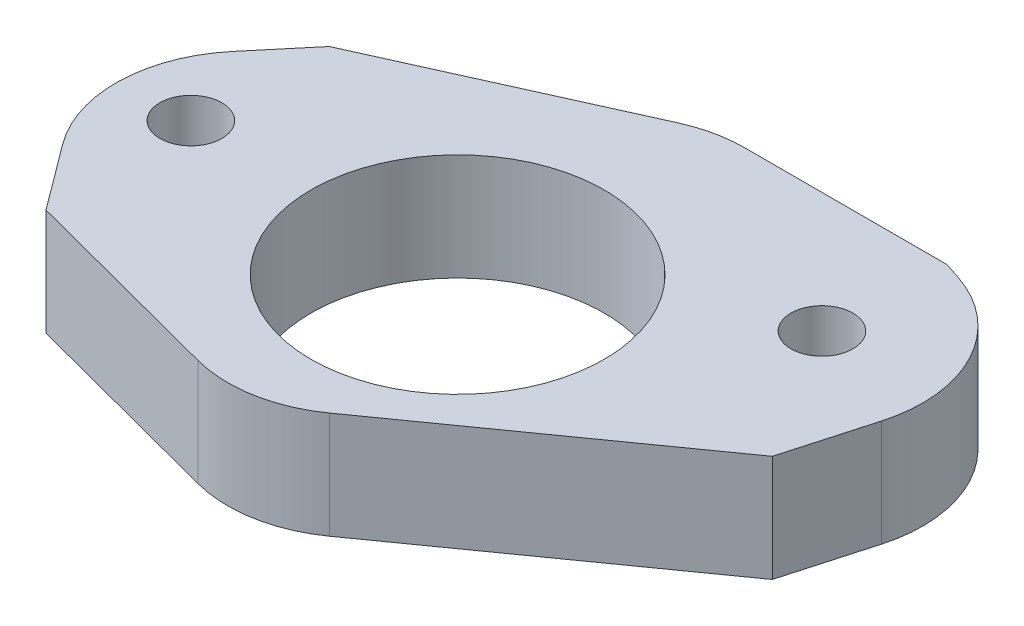
ISO-10303-21;
HEADER;
FILE_DESCRIPTION(('STEP AP214'),'2;1');
FILE_NAME('part.step','',(''),(''),'','','');
FILE_SCHEMA(('AUTOMOTIVE_DESIGN { 1 0 10303 214 1 1 1 1 }'));
ENDSEC;
DATA;
#1=APPLICATION_CONTEXT('core data for automotive mechanical design processes');
#2=APPLICATION_PROTOCOL_DEFINITION('international standard','automotive_design',2000,#1);
#3=PRODUCT_CONTEXT('',#1,'mechanical');
#4=PRODUCT('Part','Part','',(#3));
#5=PRODUCT_RELATED_PRODUCT_CATEGORY('part','',(#4));
#6=PRODUCT_DEFINITION_FORMATION('','',#4);
#7=PRODUCT_DEFINITION_CONTEXT('part definition',#1,'design');
#8=PRODUCT_DEFINITION('design','',#6,#7);
#9=PRODUCT_DEFINITION_SHAPE('','',#8);
#10=(LENGTH_UNIT() NAMED_UNIT(*) SI_UNIT(.MILLI.,.METRE.));
#11=(NAMED_UNIT(*) PLANE_ANGLE_UNIT() SI_UNIT($,.RADIAN.));
#12=(NAMED_UNIT(*) SI_UNIT($,.STERADIAN.) SOLID_ANGLE_UNIT());
#13=UNCERTAINTY_MEASURE_WITH_UNIT(LENGTH_MEASURE(1.E-05),#10,'distance_accuracy_value','');
#14=(GEOMETRIC_REPRESENTATION_CONTEXT(3) GLOBAL_UNCERTAINTY_ASSIGNED_CONTEXT((#13)) GLOBAL_UNIT_ASSIGNED_CONTEXT((#10,
#11,#12)) REPRESENTATION_CONTEXT('',''));
#15=CARTESIAN_POINT('',(0.,0.,0.));
#16=DIRECTION('',(0.,0.,1.));
#17=DIRECTION('',(1.,0.,0.));
#18=AXIS2_PLACEMENT_3D('',#15,#16,#17);
#19=CARTESIAN_POINT('',(0.,4.,0.));
#20=DIRECTION('',(0.,1.,0.));
#21=DIRECTION('',(0.,0.,1.));
#22=AXIS2_PLACEMENT_3D('',#19,#20,#21);
#23=PLANE('',#22);
#24=CARTESIAN_POINT('',(-10.,4.,0.));
#25=DIRECTION('',(0.,1.,0.));
#26=DIRECTION('',(0.,0.,1.));
#27=AXIS2_PLACEMENT_3D('',#24,#25,#26);
#28=CIRCLE('',#27,1.16205649049701);
#29=CARTESIAN_POINT('',(-10.,4.,1.16205649049701));
#30=VERTEX_POINT('',#29);
#31=EDGE_CURVE('E246',#30,#30,#28,.T.);
#32=ORIENTED_EDGE('',*,*,#31,.F.);
#33=EDGE_LOOP('',(#32));
#34=FACE_BOUND('',#33,.T.);
#35=DIRECTION('',(-1.,0.,0.));
#36=VECTOR('',#35,1.);
#37=CARTESIAN_POINT('',(0.18824153473279,4.,-9.5));
#38=LINE('',#37,#36);
#39=CARTESIAN_POINT('',(8.84849557257721,4.,-9.5));
#40=VERTEX_POINT('',#39);
#41=CARTESIAN_POINT('',(1.26141497887797,4.,-9.5));
#42=VERTEX_POINT('',#41);
#43=EDGE_CURVE('E226',#40,#42,#38,.T.);
#44=ORIENTED_EDGE('',*,*,#43,.T.);
#45=CARTESIAN_POINT('',(1.26141497887797,4.,-4.5));
#46=DIRECTION('',(0.,1.,0.));
#47=DIRECTION('',(0.,0.,1.));
#48=AXIS2_PLACEMENT_3D('',#45,#46,#47);
#49=CIRCLE('',#48,5.);
#50=CARTESIAN_POINT('',(-0.790408407766036,4.,-9.05960752587552));
#51=VERTEX_POINT('',#50);
#52=EDGE_CURVE('E177',#42,#51,#49,.T.);
#53=ORIENTED_EDGE('',*,*,#52,.T.);
#54=DIRECTION('',(-0.911921505175105,0.,0.410364677328802));
#55=VECTOR('',#54,1.);
#56=CARTESIAN_POINT('',(-9.81175846526721,4.,-4.99999999999995));
#57=LINE('',#56,#55);
#58=CARTESIAN_POINT('',(-9.81175846526721,4.,-4.99999999999995));
#59=VERTEX_POINT('',#58);
#60=EDGE_CURVE('E237',#51,#59,#57,.T.);
#61=ORIENTED_EDGE('',*,*,#60,.T.);
#62=DIRECTION('',(-0.642134491274678,0.,0.766592000424875));
#63=VECTOR('',#62,1.);
#64=CARTESIAN_POINT('',(-9.81175846526721,4.,-4.99999999999995));
#65=LINE('',#64,#63);
#66=CARTESIAN_POINT('',(-11.4622093265826,4.,-3.02966131772926));
#67=VERTEX_POINT('',#66);
#68=EDGE_CURVE('E202',#59,#67,#65,.T.);
#69=ORIENTED_EDGE('',*,*,#68,.T.);
#70=CARTESIAN_POINT('',(-7.62924932445821,4.,0.181011138644129));
#71=DIRECTION('',(0.,1.,0.));
#72=DIRECTION('',(0.,0.,1.));
#73=AXIS2_PLACEMENT_3D('',#70,#71,#72);
#74=CIRCLE('',#73,5.);
#75=CARTESIAN_POINT('',(-11.6383271953619,4.,3.16886900424459));
#76=VERTEX_POINT('',#75);
#77=EDGE_CURVE('E133',#67,#76,#74,.T.);
#78=ORIENTED_EDGE('',*,*,#77,.T.);
#79=DIRECTION('',(0.597571573120092,0.,0.801815574180733));
#80=VECTOR('',#79,1.);
#81=CARTESIAN_POINT('',(-14.,4.,0.));
#82=LINE('',#81,#80);
#83=CARTESIAN_POINT('',(-9.81175846526721,4.,5.61974070059132));
#84=VERTEX_POINT('',#83);
#85=EDGE_CURVE('E126',#76,#84,#82,.T.);
#86=ORIENTED_EDGE('',*,*,#85,.T.);
#87=DIRECTION('',(0.967105958740978,0.,0.254373867698107));
#88=VECTOR('',#87,1.);
#89=CARTESIAN_POINT('',(-9.81175846526721,4.,5.61974070059132));
#90=LINE('',#89,#88);
#91=CARTESIAN_POINT('',(-2.07330439040699,4.,7.65515416820039));
#92=VERTEX_POINT('',#91);
#93=EDGE_CURVE('E130',#84,#92,#90,.T.);
#94=ORIENTED_EDGE('',*,*,#93,.T.);
#95=CARTESIAN_POINT('',(-0.801435051916459,4.,2.8196243744955));
#96=DIRECTION('',(0.,1.,0.));
#97=DIRECTION('',(0.,0.,1.));
#98=AXIS2_PLACEMENT_3D('',#95,#96,#97);
#99=CIRCLE('',#98,5.);
#100=CARTESIAN_POINT('',(2.09453596712266,4.,6.89557234483142));
#101=VERTEX_POINT('',#100);
#102=EDGE_CURVE('E175',#92,#101,#99,.T.);
#103=ORIENTED_EDGE('',*,*,#102,.T.);
#104=DIRECTION('',(0.815189594067184,0.,-0.579194203807824));
#105=VECTOR('',#104,1.);
#106=CARTESIAN_POINT('',(0.18824153473279,4.,8.24999920948586));
#107=LINE('',#106,#105);
#108=CARTESIAN_POINT('',(11.7997415504802,4.,0.));
#109=VERTEX_POINT('',#108);
#110=EDGE_CURVE('E147',#101,#109,#107,.T.);
#111=ORIENTED_EDGE('',*,*,#110,.T.);
#112=DIRECTION('',(0.271489704959781,0.,-0.962441343719632));
#113=VECTOR('',#112,1.);
#114=CARTESIAN_POINT('',(14.,4.,-7.8));
#115=LINE('',#114,#113);
#116=CARTESIAN_POINT('',(12.7007525809019,4.,-3.19411841768981));
#117=VERTEX_POINT('',#116);
#118=EDGE_CURVE('E242',#109,#117,#115,.T.);
#119=ORIENTED_EDGE('',*,*,#118,.T.);
#120=CARTESIAN_POINT('',(7.88854586230369,4.,-4.55156694248872));
#121=DIRECTION('',(0.,1.,0.));
#122=DIRECTION('',(0.,0.,1.));
#123=AXIS2_PLACEMENT_3D('',#120,#121,#122);
#124=CIRCLE('',#123,5.);
#125=CARTESIAN_POINT('',(9.45543607484252,4.,-9.2997092173));
#126=VERTEX_POINT('',#125);
#127=EDGE_CURVE('E58',#117,#126,#124,.T.);
#128=ORIENTED_EDGE('',*,*,#127,.T.);
#129=DIRECTION('',(-0.949628454962256,0.,-0.313378042507764));
#130=VECTOR('',#129,1.);
#131=CARTESIAN_POINT('',(8.84849557257721,4.,-9.5));
#132=LINE('',#131,#130);
#133=EDGE_CURVE('E238',#126,#40,#132,.T.);
#134=ORIENTED_EDGE('',*,*,#133,.T.);
#135=EDGE_LOOP('',(#44,#53,#61,#69,#78,#86,#94,#103,#111,#119,#128,#134));
#136=FACE_BOUND('',#135,.T.);
#137=CARTESIAN_POINT('',(0.,4.,0.));
#138=DIRECTION('',(0.,1.,0.));
#139=DIRECTION('',(0.,0.,1.));
#140=AXIS2_PLACEMENT_3D('',#137,#138,#139);
#141=CIRCLE('',#140,5.5);
#142=CARTESIAN_POINT('',(0.,4.,5.5));
#143=VERTEX_POINT('',#142);
#144=EDGE_CURVE('E194',#143,#143,#141,.T.);
#145=ORIENTED_EDGE('',*,*,#144,.F.);
#146=EDGE_LOOP('',(#145));
#147=FACE_BOUND('',#146,.T.);
#148=CARTESIAN_POINT('',(8.66025403784442,4.,-4.99999999999995));
#149=DIRECTION('',(0.,1.,0.));
#150=DIRECTION('',(0.,0.,1.));
#151=AXIS2_PLACEMENT_3D('',#148,#149,#150);
#152=CIRCLE('',#151,1.16205649049701);
#153=CARTESIAN_POINT('',(8.66025403784442,4.,-3.83794350950294));
#154=VERTEX_POINT('',#153);
#155=EDGE_CURVE('E251',#154,#154,#152,.T.);
#156=ORIENTED_EDGE('',*,*,#155,.F.);
#157=EDGE_LOOP('',(#156));
#158=FACE_BOUND('',#157,.T.);
#159=ADVANCED_FACE('F37',(#34,#136,#147,#158),#23,.T.);
#160=CARTESIAN_POINT('',(0.,0.,0.));
#161=DIRECTION('',(0.,1.,0.));
#162=DIRECTION('',(0.,0.,1.));
#163=AXIS2_PLACEMENT_3D('',#160,#161,#162);
#164=PLANE('',#163);
#165=DIRECTION('',(-0.911921505175105,0.,0.410364677328802));
#166=VECTOR('',#165,1.);
#167=CARTESIAN_POINT('',(-9.81175846526721,0.,-4.99999999999995));
#168=LINE('',#167,#166);
#169=CARTESIAN_POINT('',(-0.790408407766036,0.,-9.05960752587552));
#170=VERTEX_POINT('',#169);
#171=CARTESIAN_POINT('',(-9.81175846526721,0.,-4.99999999999995));
#172=VERTEX_POINT('',#171);
#173=EDGE_CURVE('E214',#170,#172,#168,.T.);
#174=ORIENTED_EDGE('',*,*,#173,.F.);
#175=CARTESIAN_POINT('',(1.26141497887797,0.,-4.5));
#176=DIRECTION('',(0.,1.,0.));
#177=DIRECTION('',(0.,0.,1.));
#178=AXIS2_PLACEMENT_3D('',#175,#176,#177);
#179=CIRCLE('',#178,5.);
#180=CARTESIAN_POINT('',(1.26141497887797,0.,-9.5));
#181=VERTEX_POINT('',#180);
#182=EDGE_CURVE('E169',#170,#181,#179,.F.);
#183=ORIENTED_EDGE('',*,*,#182,.T.);
#184=DIRECTION('',(-1.,0.,0.));
#185=VECTOR('',#184,1.);
#186=CARTESIAN_POINT('',(0.18824153473279,0.,-9.5));
#187=LINE('',#186,#185);
#188=CARTESIAN_POINT('',(8.84849557257721,0.,-9.5));
#189=VERTEX_POINT('',#188);
#190=EDGE_CURVE('E211',#189,#181,#187,.T.);
#191=ORIENTED_EDGE('',*,*,#190,.F.);
#192=DIRECTION('',(-0.949628454962256,0.,-0.313378042507764));
#193=VECTOR('',#192,1.);
#194=CARTESIAN_POINT('',(8.84849557257721,0.,-9.5));
#195=LINE('',#194,#193);
#196=CARTESIAN_POINT('',(9.45543607484252,0.,-9.2997092173));
#197=VERTEX_POINT('',#196);
#198=EDGE_CURVE('E209',#197,#189,#195,.T.);
#199=ORIENTED_EDGE('',*,*,#198,.F.);
#200=CARTESIAN_POINT('',(7.88854586230369,0.,-4.55156694248872));
#201=DIRECTION('',(0.,1.,0.));
#202=DIRECTION('',(0.,0.,1.));
#203=AXIS2_PLACEMENT_3D('',#200,#201,#202);
#204=CIRCLE('',#203,5.);
#205=CARTESIAN_POINT('',(12.7007525809019,0.,-3.19411841768981));
#206=VERTEX_POINT('',#205);
#207=EDGE_CURVE('E165',#197,#206,#204,.F.);
#208=ORIENTED_EDGE('',*,*,#207,.T.);
#209=DIRECTION('',(0.271489704959781,0.,-0.962441343719632));
#210=VECTOR('',#209,1.);
#211=CARTESIAN_POINT('',(14.,0.,-7.8));
#212=LINE('',#211,#210);
#213=CARTESIAN_POINT('',(11.7997415504802,0.,0.));
#214=VERTEX_POINT('',#213);
#215=EDGE_CURVE('E206',#214,#206,#212,.T.);
#216=ORIENTED_EDGE('',*,*,#215,.F.);
#217=DIRECTION('',(0.815189594067184,0.,-0.579194203807824));
#218=VECTOR('',#217,1.);
#219=CARTESIAN_POINT('',(0.18824153473279,0.,8.24999920948586));
#220=LINE('',#219,#218);
#221=CARTESIAN_POINT('',(2.09453596712266,0.,6.89557234483142));
#222=VERTEX_POINT('',#221);
#223=EDGE_CURVE('E196',#222,#214,#220,.T.);
#224=ORIENTED_EDGE('',*,*,#223,.F.);
#225=CARTESIAN_POINT('',(-0.801435051916459,0.,2.8196243744955));
#226=DIRECTION('',(0.,1.,0.));
#227=DIRECTION('',(0.,0.,1.));
#228=AXIS2_PLACEMENT_3D('',#225,#226,#227);
#229=CIRCLE('',#228,5.);
#230=CARTESIAN_POINT('',(-2.07330439040699,0.,7.65515416820039));
#231=VERTEX_POINT('',#230);
#232=EDGE_CURVE('E167',#222,#231,#229,.F.);
#233=ORIENTED_EDGE('',*,*,#232,.T.);
#234=DIRECTION('',(0.967105958740978,0.,0.254373867698107));
#235=VECTOR('',#234,1.);
#236=CARTESIAN_POINT('',(-9.81175846526721,0.,5.61974070059132));
#237=LINE('',#236,#235);
#238=CARTESIAN_POINT('',(-9.81175846526721,0.,5.61974070059132));
#239=VERTEX_POINT('',#238);
#240=EDGE_CURVE('E193',#239,#231,#237,.T.);
#241=ORIENTED_EDGE('',*,*,#240,.F.);
#242=DIRECTION('',(0.597571573120092,0.,0.801815574180733));
#243=VECTOR('',#242,1.);
#244=CARTESIAN_POINT('',(-14.,0.,0.));
#245=LINE('',#244,#243);
#246=CARTESIAN_POINT('',(-11.6383271953619,0.,3.16886900424459));
#247=VERTEX_POINT('',#246);
#248=EDGE_CURVE('E151',#247,#239,#245,.T.);
#249=ORIENTED_EDGE('',*,*,#248,.F.);
#250=CARTESIAN_POINT('',(-7.62924932445821,0.,0.181011138644129));
#251=DIRECTION('',(0.,1.,0.));
#252=DIRECTION('',(0.,0.,1.));
#253=AXIS2_PLACEMENT_3D('',#250,#251,#252);
#254=CIRCLE('',#253,5.);
#255=CARTESIAN_POINT('',(-11.4622093265826,0.,-3.02966131772926));
#256=VERTEX_POINT('',#255);
#257=EDGE_CURVE('E157',#247,#256,#254,.F.);
#258=ORIENTED_EDGE('',*,*,#257,.T.);
#259=DIRECTION('',(-0.642134491274678,0.,0.766592000424875));
#260=VECTOR('',#259,1.);
#261=CARTESIAN_POINT('',(-9.81175846526721,0.,-4.99999999999995));
#262=LINE('',#261,#260);
#263=EDGE_CURVE('E138',#172,#256,#262,.T.);
#264=ORIENTED_EDGE('',*,*,#263,.F.);
#265=EDGE_LOOP('',(#174,#183,#191,#199,#208,#216,#224,#233,#241,#249,#258,#264));
#266=FACE_BOUND('',#265,.T.);
#267=CARTESIAN_POINT('',(0.,0.,0.));
#268=DIRECTION('',(0.,1.,0.));
#269=DIRECTION('',(0.,0.,1.));
#270=AXIS2_PLACEMENT_3D('',#267,#268,#269);
#271=CIRCLE('',#270,5.5);
#272=CARTESIAN_POINT('',(0.,0.,5.5));
#273=VERTEX_POINT('',#272);
#274=EDGE_CURVE('E199',#273,#273,#271,.T.);
#275=ORIENTED_EDGE('',*,*,#274,.T.);
#276=EDGE_LOOP('',(#275));
#277=FACE_BOUND('',#276,.T.);
#278=CARTESIAN_POINT('',(-10.,0.,0.));
#279=DIRECTION('',(0.,1.,0.));
#280=DIRECTION('',(0.,0.,1.));
#281=AXIS2_PLACEMENT_3D('',#278,#279,#280);
#282=CIRCLE('',#281,1.16205649049701);
#283=CARTESIAN_POINT('',(-10.,0.,1.16205649049701));
#284=VERTEX_POINT('',#283);
#285=EDGE_CURVE('E248',#284,#284,#282,.T.);
#286=ORIENTED_EDGE('',*,*,#285,.T.);
#287=EDGE_LOOP('',(#286));
#288=FACE_BOUND('',#287,.T.);
#289=CARTESIAN_POINT('',(8.66025403784442,0.,-4.99999999999995));
#290=DIRECTION('',(0.,1.,0.));
#291=DIRECTION('',(0.,0.,1.));
#292=AXIS2_PLACEMENT_3D('',#289,#290,#291);
#293=CIRCLE('',#292,1.16205649049701);
#294=CARTESIAN_POINT('',(8.66025403784442,0.,-3.83794350950294));
#295=VERTEX_POINT('',#294);
#296=EDGE_CURVE('E254',#295,#295,#293,.T.);
#297=ORIENTED_EDGE('',*,*,#296,.T.);
#298=EDGE_LOOP('',(#297));
#299=FACE_BOUND('',#298,.T.);
#300=ADVANCED_FACE('F190',(#266,#277,#288,#299),#164,.F.);
#301=CARTESIAN_POINT('',(-14.,4.,0.));
#302=DIRECTION('',(0.801815574180733,0.,-0.597571573120092));
#303=DIRECTION('',(-0.597571573120092,0.,-0.801815574180733));
#304=AXIS2_PLACEMENT_3D('',#301,#302,#303);
#305=PLANE('',#304);
#306=ORIENTED_EDGE('',*,*,#85,.F.);
#307=DIRECTION('',(0.,-1.,0.));
#308=VECTOR('',#307,1.);
#309=CARTESIAN_POINT('',(-11.6383271953619,4.,3.16886900424459));
#310=LINE('',#309,#308);
#311=EDGE_CURVE('E45',#76,#247,#310,.T.);
#312=ORIENTED_EDGE('',*,*,#311,.T.);
#313=ORIENTED_EDGE('',*,*,#248,.T.);
#314=DIRECTION('',(0.,-1.,0.));
#315=VECTOR('',#314,1.);
#316=CARTESIAN_POINT('',(-9.81175846526721,4.,5.61974070059132));
#317=LINE('',#316,#315);
#318=EDGE_CURVE('E144',#84,#239,#317,.T.);
#319=ORIENTED_EDGE('',*,*,#318,.F.);
#320=EDGE_LOOP('',(#306,#312,#313,#319));
#321=FACE_BOUND('',#320,.T.);
#322=ADVANCED_FACE('F149',(#321),#305,.F.);
#323=CARTESIAN_POINT('',(-9.81175846526721,4.,5.61974070059132));
#324=DIRECTION('',(0.254373867698107,0.,-0.967105958740978));
#325=DIRECTION('',(-0.967105958740978,0.,-0.254373867698107));
#326=AXIS2_PLACEMENT_3D('',#323,#324,#325);
#327=PLANE('',#326);
#328=ORIENTED_EDGE('',*,*,#240,.T.);
#329=DIRECTION('',(0.,-1.,0.));
#330=VECTOR('',#329,1.);
#331=CARTESIAN_POINT('',(-2.07330439040699,4.,7.65515416820039));
#332=LINE('',#331,#330);
#333=EDGE_CURVE('E146',#231,#92,#332,.F.);
#334=ORIENTED_EDGE('',*,*,#333,.T.);
#335=ORIENTED_EDGE('',*,*,#93,.F.);
#336=ORIENTED_EDGE('',*,*,#318,.T.);
#337=EDGE_LOOP('',(#328,#334,#335,#336));
#338=FACE_BOUND('',#337,.T.);
#339=ADVANCED_FACE('F143',(#338),#327,.F.);
#340=CARTESIAN_POINT('',(0.18824153473279,4.,8.24999920948586));
#341=DIRECTION('',(-0.579194203807824,0.,-0.815189594067184));
#342=DIRECTION('',(-0.815189594067184,0.,0.579194203807824));
#343=AXIS2_PLACEMENT_3D('',#340,#341,#342);
#344=PLANE('',#343);
#345=ORIENTED_EDGE('',*,*,#110,.F.);
#346=DIRECTION('',(0.,-1.,0.));
#347=VECTOR('',#346,1.);
#348=CARTESIAN_POINT('',(2.09453596712266,4.,6.89557234483142));
#349=LINE('',#348,#347);
#350=EDGE_CURVE('E179',#101,#222,#349,.T.);
#351=ORIENTED_EDGE('',*,*,#350,.T.);
#352=ORIENTED_EDGE('',*,*,#223,.T.);
#353=DIRECTION('',(0.,-1.,0.));
#354=VECTOR('',#353,1.);
#355=CARTESIAN_POINT('',(11.7997415504802,4.,0.));
#356=LINE('',#355,#354);
#357=EDGE_CURVE('E154',#109,#214,#356,.T.);
#358=ORIENTED_EDGE('',*,*,#357,.F.);
#359=EDGE_LOOP('',(#345,#351,#352,#358));
#360=FACE_BOUND('',#359,.T.);
#361=ADVANCED_FACE('F288',(#360),#344,.F.);
#362=CARTESIAN_POINT('',(14.,4.,-7.8));
#363=DIRECTION('',(-0.962441343719632,0.,-0.271489704959781));
#364=DIRECTION('',(-0.271489704959781,0.,0.962441343719632));
#365=AXIS2_PLACEMENT_3D('',#362,#363,#364);
#366=PLANE('',#365);
#367=ORIENTED_EDGE('',*,*,#215,.T.);
#368=DIRECTION('',(0.,-1.,0.));
#369=VECTOR('',#368,1.);
#370=CARTESIAN_POINT('',(12.7007525809019,4.,-3.19411841768981));
#371=LINE('',#370,#369);
#372=EDGE_CURVE('E186',#206,#117,#371,.F.);
#373=ORIENTED_EDGE('',*,*,#372,.T.);
#374=ORIENTED_EDGE('',*,*,#118,.F.);
#375=ORIENTED_EDGE('',*,*,#357,.T.);
#376=EDGE_LOOP('',(#367,#373,#374,#375));
#377=FACE_BOUND('',#376,.T.);
#378=ADVANCED_FACE('F285',(#377),#366,.F.);
#379=CARTESIAN_POINT('',(8.84849557257721,4.,-9.5));
#380=DIRECTION('',(-0.313378042507764,0.,0.949628454962256));
#381=DIRECTION('',(0.949628454962256,0.,0.313378042507764));
#382=AXIS2_PLACEMENT_3D('',#379,#380,#381);
#383=PLANE('',#382);
#384=ORIENTED_EDGE('',*,*,#133,.F.);
#385=DIRECTION('',(0.,-1.,0.));
#386=VECTOR('',#385,1.);
#387=CARTESIAN_POINT('',(9.45543607484252,4.,-9.2997092173));
#388=LINE('',#387,#386);
#389=EDGE_CURVE('E183',#126,#197,#388,.T.);
#390=ORIENTED_EDGE('',*,*,#389,.T.);
#391=ORIENTED_EDGE('',*,*,#198,.T.);
#392=DIRECTION('',(0.,-1.,0.));
#393=VECTOR('',#392,1.);
#394=CARTESIAN_POINT('',(8.84849557257721,4.,-9.5));
#395=LINE('',#394,#393);
#396=EDGE_CURVE('E160',#40,#189,#395,.T.);
#397=ORIENTED_EDGE('',*,*,#396,.F.);
#398=EDGE_LOOP('',(#384,#390,#391,#397));
#399=FACE_BOUND('',#398,.T.);
#400=ADVANCED_FACE('F282',(#399),#383,.F.);
#401=CARTESIAN_POINT('',(0.18824153473279,4.,-9.5));
#402=DIRECTION('',(0.,0.,1.));
#403=DIRECTION('',(1.,0.,0.));
#404=AXIS2_PLACEMENT_3D('',#401,#402,#403);
#405=PLANE('',#404);
#406=ORIENTED_EDGE('',*,*,#190,.T.);
#407=DIRECTION('',(0.,-1.,0.));
#408=VECTOR('',#407,1.);
#409=CARTESIAN_POINT('',(1.26141497887797,4.,-9.5));
#410=LINE('',#409,#408);
#411=EDGE_CURVE('E171',#181,#42,#410,.F.);
#412=ORIENTED_EDGE('',*,*,#411,.T.);
#413=ORIENTED_EDGE('',*,*,#43,.F.);
#414=ORIENTED_EDGE('',*,*,#396,.T.);
#415=EDGE_LOOP('',(#406,#412,#413,#414));
#416=FACE_BOUND('',#415,.T.);
#417=ADVANCED_FACE('F224',(#416),#405,.F.);
#418=CARTESIAN_POINT('',(-9.81175846526721,4.,-4.99999999999995));
#419=DIRECTION('',(0.410364677328802,0.,0.911921505175105));
#420=DIRECTION('',(0.911921505175105,0.,-0.410364677328802));
#421=AXIS2_PLACEMENT_3D('',#418,#419,#420);
#422=PLANE('',#421);
#423=ORIENTED_EDGE('',*,*,#60,.F.);
#424=DIRECTION('',(0.,-1.,0.));
#425=VECTOR('',#424,1.);
#426=CARTESIAN_POINT('',(-0.790408407766036,4.,-9.05960752587552));
#427=LINE('',#426,#425);
#428=EDGE_CURVE('E153',#51,#170,#427,.T.);
#429=ORIENTED_EDGE('',*,*,#428,.T.);
#430=ORIENTED_EDGE('',*,*,#173,.T.);
#431=DIRECTION('',(0.,-1.,0.));
#432=VECTOR('',#431,1.);
#433=CARTESIAN_POINT('',(-9.81175846526721,4.,-4.99999999999995));
#434=LINE('',#433,#432);
#435=EDGE_CURVE('E217',#59,#172,#434,.T.);
#436=ORIENTED_EDGE('',*,*,#435,.F.);
#437=EDGE_LOOP('',(#423,#429,#430,#436));
#438=FACE_BOUND('',#437,.T.);
#439=ADVANCED_FACE('F235',(#438),#422,.F.);
#440=CARTESIAN_POINT('',(-9.81175846526721,4.,-4.99999999999995));
#441=DIRECTION('',(0.766592000424875,0.,0.642134491274678));
#442=DIRECTION('',(0.642134491274678,0.,-0.766592000424875));
#443=AXIS2_PLACEMENT_3D('',#440,#441,#442);
#444=PLANE('',#443);
#445=ORIENTED_EDGE('',*,*,#263,.T.);
#446=DIRECTION('',(0.,-1.,0.));
#447=VECTOR('',#446,1.);
#448=CARTESIAN_POINT('',(-11.4622093265826,4.,-3.02966131772926));
#449=LINE('',#448,#447);
#450=EDGE_CURVE('E11',#256,#67,#449,.F.);
#451=ORIENTED_EDGE('',*,*,#450,.T.);
#452=ORIENTED_EDGE('',*,*,#68,.F.);
#453=ORIENTED_EDGE('',*,*,#435,.T.);
#454=EDGE_LOOP('',(#445,#451,#452,#453));
#455=FACE_BOUND('',#454,.T.);
#456=ADVANCED_FACE('F275',(#455),#444,.F.);
#457=CARTESIAN_POINT('',(0.,4.,0.));
#458=DIRECTION('',(0.,-1.,0.));
#459=DIRECTION('',(0.,0.,-1.));
#460=AXIS2_PLACEMENT_3D('',#457,#458,#459);
#461=CYLINDRICAL_SURFACE('',#460,5.5);
#462=ORIENTED_EDGE('',*,*,#144,.T.);
#463=EDGE_LOOP('',(#462));
#464=FACE_BOUND('',#463,.T.);
#465=ORIENTED_EDGE('',*,*,#274,.F.);
#466=EDGE_LOOP('',(#465));
#467=FACE_BOUND('',#466,.T.);
#468=ADVANCED_FACE('F272',(#464,#467),#461,.F.);
#469=CARTESIAN_POINT('',(-10.,4.,0.));
#470=DIRECTION('',(0.,-1.,0.));
#471=DIRECTION('',(0.,0.,-1.));
#472=AXIS2_PLACEMENT_3D('',#469,#470,#471);
#473=CYLINDRICAL_SURFACE('',#472,1.16205649049701);
#474=ORIENTED_EDGE('',*,*,#31,.T.);
#475=EDGE_LOOP('',(#474));
#476=FACE_BOUND('',#475,.T.);
#477=ORIENTED_EDGE('',*,*,#285,.F.);
#478=EDGE_LOOP('',(#477));
#479=FACE_BOUND('',#478,.T.);
#480=ADVANCED_FACE('F417',(#476,#479),#473,.F.);
#481=CARTESIAN_POINT('',(8.66025403784442,4.,-4.99999999999995));
#482=DIRECTION('',(0.,-1.,0.));
#483=DIRECTION('',(0.,0.,-1.));
#484=AXIS2_PLACEMENT_3D('',#481,#482,#483);
#485=CYLINDRICAL_SURFACE('',#484,1.16205649049701);
#486=ORIENTED_EDGE('',*,*,#155,.T.);
#487=EDGE_LOOP('',(#486));
#488=FACE_BOUND('',#487,.T.);
#489=ORIENTED_EDGE('',*,*,#296,.F.);
#490=EDGE_LOOP('',(#489));
#491=FACE_BOUND('',#490,.T.);
#492=ADVANCED_FACE('F260',(#488,#491),#485,.F.);
#493=CARTESIAN_POINT('',(1.26141497887797,4.,-4.5));
#494=DIRECTION('',(0.,-1.,0.));
#495=DIRECTION('',(0.,0.,-1.));
#496=AXIS2_PLACEMENT_3D('',#493,#494,#495);
#497=CYLINDRICAL_SURFACE('',#496,5.);
#498=ORIENTED_EDGE('',*,*,#52,.F.);
#499=ORIENTED_EDGE('',*,*,#411,.F.);
#500=ORIENTED_EDGE('',*,*,#182,.F.);
#501=ORIENTED_EDGE('',*,*,#428,.F.);
#502=EDGE_LOOP('',(#498,#499,#500,#501));
#503=FACE_BOUND('',#502,.T.);
#504=ADVANCED_FACE('F232',(#503),#497,.T.);
#505=CARTESIAN_POINT('',(-0.801435051916459,4.,2.8196243744955));
#506=DIRECTION('',(0.,-1.,0.));
#507=DIRECTION('',(0.,0.,-1.));
#508=AXIS2_PLACEMENT_3D('',#505,#506,#507);
#509=CYLINDRICAL_SURFACE('',#508,5.);
#510=ORIENTED_EDGE('',*,*,#102,.F.);
#511=ORIENTED_EDGE('',*,*,#333,.F.);
#512=ORIENTED_EDGE('',*,*,#232,.F.);
#513=ORIENTED_EDGE('',*,*,#350,.F.);
#514=EDGE_LOOP('',(#510,#511,#512,#513));
#515=FACE_BOUND('',#514,.T.);
#516=ADVANCED_FACE('F299',(#515),#509,.T.);
#517=CARTESIAN_POINT('',(7.88854586230369,4.,-4.55156694248872));
#518=DIRECTION('',(0.,-1.,0.));
#519=DIRECTION('',(0.,0.,-1.));
#520=AXIS2_PLACEMENT_3D('',#517,#518,#519);
#521=CYLINDRICAL_SURFACE('',#520,5.);
#522=ORIENTED_EDGE('',*,*,#127,.F.);
#523=ORIENTED_EDGE('',*,*,#372,.F.);
#524=ORIENTED_EDGE('',*,*,#207,.F.);
#525=ORIENTED_EDGE('',*,*,#389,.F.);
#526=EDGE_LOOP('',(#522,#523,#524,#525));
#527=FACE_BOUND('',#526,.T.);
#528=ADVANCED_FACE('F301',(#527),#521,.T.);
#529=CARTESIAN_POINT('',(-7.62924932445821,4.,0.181011138644129));
#530=DIRECTION('',(0.,-1.,0.));
#531=DIRECTION('',(0.,0.,-1.));
#532=AXIS2_PLACEMENT_3D('',#529,#530,#531);
#533=CYLINDRICAL_SURFACE('',#532,5.);
#534=ORIENTED_EDGE('',*,*,#77,.F.);
#535=ORIENTED_EDGE('',*,*,#450,.F.);
#536=ORIENTED_EDGE('',*,*,#257,.F.);
#537=ORIENTED_EDGE('',*,*,#311,.F.);
#538=EDGE_LOOP('',(#534,#535,#536,#537));
#539=FACE_BOUND('',#538,.T.);
#540=ADVANCED_FACE('F39',(#539),#533,.T.);
#541=CLOSED_SHELL('',(#159,#300,#322,#339,#361,#378,#400,#417,#439,#456,#468,#480,#492,#504,
#516,#528,#540));
#542=MANIFOLD_SOLID_BREP('B2',#541);
#543=ADVANCED_BREP_SHAPE_REPRESENTATION('',(#18,#542),#14);
#544=SHAPE_DEFINITION_REPRESENTATION(#9,#543);
ENDSEC;
END-ISO-10303-21;
